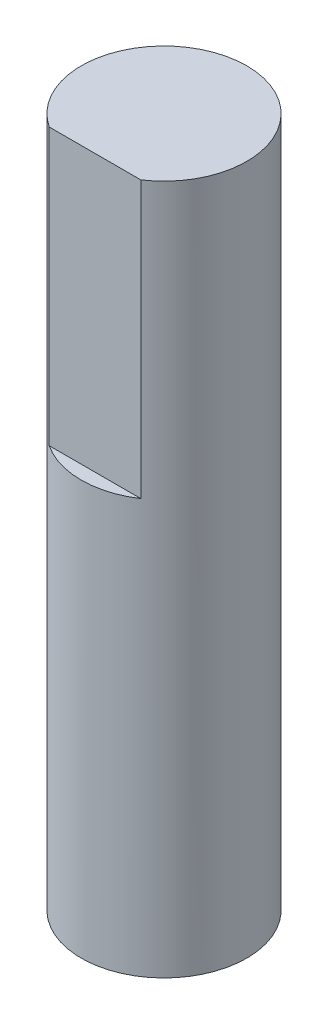
ISO-10303-21;
HEADER;
FILE_DESCRIPTION(('STEP AP214'),'2;1');
FILE_NAME('part.step','',(''),(''),'','','');
FILE_SCHEMA(('AUTOMOTIVE_DESIGN { 1 0 10303 214 1 1 1 1 }'));
ENDSEC;
DATA;
#1=APPLICATION_CONTEXT('core data for automotive mechanical design processes');
#2=APPLICATION_PROTOCOL_DEFINITION('international standard','automotive_design',2000,#1);
#3=PRODUCT_CONTEXT('',#1,'mechanical');
#4=PRODUCT('Part','Part','',(#3));
#5=PRODUCT_RELATED_PRODUCT_CATEGORY('part','',(#4));
#6=PRODUCT_DEFINITION_FORMATION('','',#4);
#7=PRODUCT_DEFINITION_CONTEXT('part definition',#1,'design');
#8=PRODUCT_DEFINITION('design','',#6,#7);
#9=PRODUCT_DEFINITION_SHAPE('','',#8);
#10=(LENGTH_UNIT() NAMED_UNIT(*) SI_UNIT(.MILLI.,.METRE.));
#11=(NAMED_UNIT(*) PLANE_ANGLE_UNIT() SI_UNIT($,.RADIAN.));
#12=(NAMED_UNIT(*) SI_UNIT($,.STERADIAN.) SOLID_ANGLE_UNIT());
#13=UNCERTAINTY_MEASURE_WITH_UNIT(LENGTH_MEASURE(1.E-05),#10,'distance_accuracy_value','');
#14=(GEOMETRIC_REPRESENTATION_CONTEXT(3) GLOBAL_UNCERTAINTY_ASSIGNED_CONTEXT((#13)) GLOBAL_UNIT_ASSIGNED_CONTEXT((#10,
#11,#12)) REPRESENTATION_CONTEXT('',''));
#15=CARTESIAN_POINT('',(0.,0.,0.));
#16=DIRECTION('',(0.,0.,1.));
#17=DIRECTION('',(1.,0.,0.));
#18=AXIS2_PLACEMENT_3D('',#15,#16,#17);
#19=CARTESIAN_POINT('',(1.658312395,15.,2.5));
#20=DIRECTION('',(0.,0.,-1.));
#21=DIRECTION('',(-1.,0.,0.));
#22=AXIS2_PLACEMENT_3D('',#19,#20,#21);
#23=PLANE('',#22);
#24=DIRECTION('',(0.,1.,0.));
#25=VECTOR('',#24,1.);
#26=CARTESIAN_POINT('',(-1.65831239506034,12.5,2.50000000007785));
#27=LINE('',#26,#25);
#28=CARTESIAN_POINT('',(-1.65831239511902,25.,2.50000000003892));
#29=VERTEX_POINT('',#28);
#30=CARTESIAN_POINT('',(-1.65831239511902,15.,2.50000000003892));
#31=VERTEX_POINT('',#30);
#32=EDGE_CURVE('E49',#29,#31,#27,.F.);
#33=ORIENTED_EDGE('',*,*,#32,.T.);
#34=DIRECTION('',(-1.,0.,0.));
#35=VECTOR('',#34,1.);
#36=CARTESIAN_POINT('',(0.,15.,2.5));
#37=LINE('',#36,#35);
#38=CARTESIAN_POINT('',(1.6583123953435,15.,2.49999999989002));
#39=VERTEX_POINT('',#38);
#40=EDGE_CURVE('E53',#39,#31,#37,.T.);
#41=ORIENTED_EDGE('',*,*,#40,.F.);
#42=DIRECTION('',(0.,-1.,0.));
#43=VECTOR('',#42,1.);
#44=CARTESIAN_POINT('',(1.65831239550931,12.5,2.49999999978004));
#45=LINE('',#44,#43);
#46=CARTESIAN_POINT('',(1.6583123953435,25.,2.49999999989002));
#47=VERTEX_POINT('',#46);
#48=EDGE_CURVE('E36',#39,#47,#45,.F.);
#49=ORIENTED_EDGE('',*,*,#48,.T.);
#50=DIRECTION('',(1.,0.,0.));
#51=VECTOR('',#50,1.);
#52=CARTESIAN_POINT('',(0.,25.,2.5));
#53=LINE('',#52,#51);
#54=EDGE_CURVE('E48',#29,#47,#53,.T.);
#55=ORIENTED_EDGE('',*,*,#54,.F.);
#56=EDGE_LOOP('',(#33,#41,#49,#55));
#57=FACE_BOUND('',#56,.T.);
#58=ADVANCED_FACE('F17',(#57),#23,.F.);
#59=CARTESIAN_POINT('',(-3.036,25.,-3.033));
#60=DIRECTION('',(0.,1.,0.));
#61=DIRECTION('',(0.,0.,1.));
#62=AXIS2_PLACEMENT_3D('',#59,#60,#61);
#63=PLANE('',#62);
#64=CARTESIAN_POINT('',(0.,25.,0.));
#65=DIRECTION('',(0.,-1.,0.));
#66=DIRECTION('',(0.,0.,-1.));
#67=AXIS2_PLACEMENT_3D('',#64,#65,#66);
#68=CIRCLE('',#67,3.);
#69=EDGE_CURVE('E21',#47,#29,#68,.F.);
#70=ORIENTED_EDGE('',*,*,#69,.T.);
#71=ORIENTED_EDGE('',*,*,#54,.T.);
#72=EDGE_LOOP('',(#70,#71));
#73=FACE_BOUND('',#72,.T.);
#74=ADVANCED_FACE('F47',(#73),#63,.T.);
#75=CARTESIAN_POINT('',(-3.036,0.,-3.036));
#76=DIRECTION('',(0.,1.,0.));
#77=DIRECTION('',(0.,0.,1.));
#78=AXIS2_PLACEMENT_3D('',#75,#76,#77);
#79=PLANE('',#78);
#80=CARTESIAN_POINT('',(0.,0.,0.));
#81=DIRECTION('',(0.,-1.,0.));
#82=DIRECTION('',(0.,0.,-1.));
#83=AXIS2_PLACEMENT_3D('',#80,#81,#82);
#84=CIRCLE('',#83,3.);
#85=CARTESIAN_POINT('',(0.,0.,-3.));
#86=VERTEX_POINT('',#85);
#87=EDGE_CURVE('E27',#86,#86,#84,.T.);
#88=ORIENTED_EDGE('',*,*,#87,.T.);
#89=EDGE_LOOP('',(#88));
#90=FACE_BOUND('',#89,.T.);
#91=ADVANCED_FACE('F60',(#90),#79,.F.);
#92=CARTESIAN_POINT('',(-1.678212144,15.,2.5));
#93=DIRECTION('',(0.,1.,0.));
#94=DIRECTION('',(0.,0.,1.));
#95=AXIS2_PLACEMENT_3D('',#92,#93,#94);
#96=PLANE('',#95);
#97=ORIENTED_EDGE('',*,*,#40,.T.);
#98=CARTESIAN_POINT('',(0.,15.,0.));
#99=DIRECTION('',(0.,-1.,0.));
#100=DIRECTION('',(0.,0.,-1.));
#101=AXIS2_PLACEMENT_3D('',#98,#99,#100);
#102=CIRCLE('',#101,3.);
#103=EDGE_CURVE('E11',#31,#39,#102,.F.);
#104=ORIENTED_EDGE('',*,*,#103,.T.);
#105=EDGE_LOOP('',(#97,#104));
#106=FACE_BOUND('',#105,.T.);
#107=ADVANCED_FACE('F19',(#106),#96,.T.);
#108=CARTESIAN_POINT('',(0.,25.,0.));
#109=DIRECTION('',(0.,-1.,0.));
#110=DIRECTION('',(0.,0.,-1.));
#111=AXIS2_PLACEMENT_3D('',#108,#109,#110);
#112=CYLINDRICAL_SURFACE('',#111,3.);
#113=ORIENTED_EDGE('',*,*,#87,.F.);
#114=EDGE_LOOP('',(#113));
#115=FACE_BOUND('',#114,.T.);
#116=ORIENTED_EDGE('',*,*,#103,.F.);
#117=ORIENTED_EDGE('',*,*,#32,.F.);
#118=ORIENTED_EDGE('',*,*,#69,.F.);
#119=ORIENTED_EDGE('',*,*,#48,.F.);
#120=EDGE_LOOP('',(#116,#117,#118,#119));
#121=FACE_BOUND('',#120,.T.);
#122=ADVANCED_FACE('F52',(#115,#121),#112,.T.);
#123=CLOSED_SHELL('',(#58,#74,#91,#107,#122));
#124=MANIFOLD_SOLID_BREP('B1',#123);
#125=ADVANCED_BREP_SHAPE_REPRESENTATION('',(#18,#124),#14);
#126=SHAPE_DEFINITION_REPRESENTATION(#9,#125);
ENDSEC;
END-ISO-10303-21;
